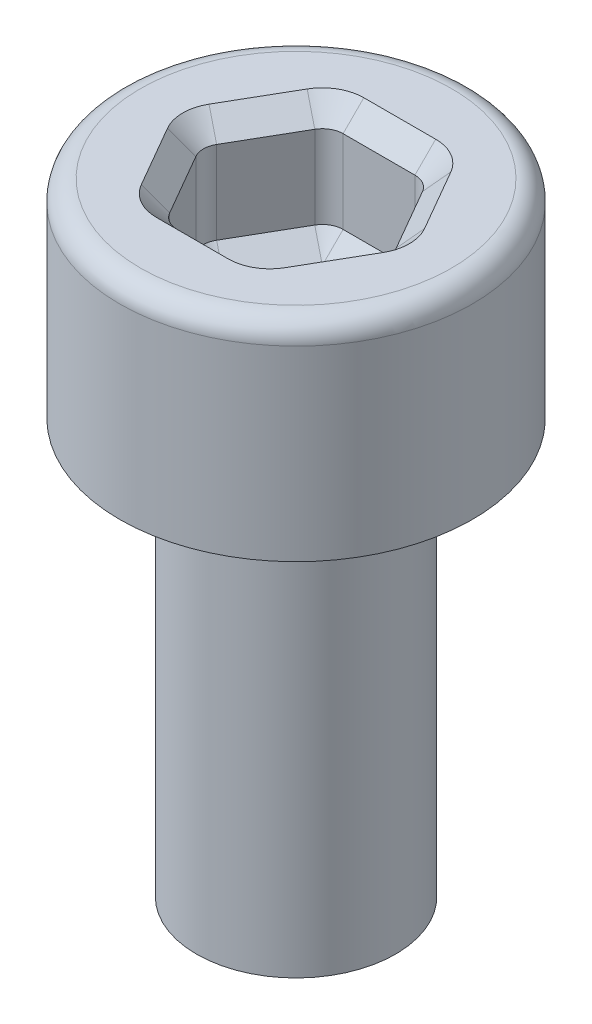
ISO-10303-21;
HEADER;
FILE_DESCRIPTION(('STEP AP214'),'2;1');
FILE_NAME('part.step','',(''),(''),'','','');
FILE_SCHEMA(('AUTOMOTIVE_DESIGN { 1 0 10303 214 1 1 1 1 }'));
ENDSEC;
DATA;
#1=APPLICATION_CONTEXT('core data for automotive mechanical design processes');
#2=APPLICATION_PROTOCOL_DEFINITION('international standard','automotive_design',2000,#1);
#3=PRODUCT_CONTEXT('',#1,'mechanical');
#4=PRODUCT('Part','Part','',(#3));
#5=PRODUCT_RELATED_PRODUCT_CATEGORY('part','',(#4));
#6=PRODUCT_DEFINITION_FORMATION('','',#4);
#7=PRODUCT_DEFINITION_CONTEXT('part definition',#1,'design');
#8=PRODUCT_DEFINITION('design','',#6,#7);
#9=PRODUCT_DEFINITION_SHAPE('','',#8);
#10=(LENGTH_UNIT() NAMED_UNIT(*) SI_UNIT(.MILLI.,.METRE.));
#11=(NAMED_UNIT(*) PLANE_ANGLE_UNIT() SI_UNIT($,.RADIAN.));
#12=(NAMED_UNIT(*) SI_UNIT($,.STERADIAN.) SOLID_ANGLE_UNIT());
#13=UNCERTAINTY_MEASURE_WITH_UNIT(LENGTH_MEASURE(1.E-05),#10,'distance_accuracy_value','');
#14=(GEOMETRIC_REPRESENTATION_CONTEXT(3) GLOBAL_UNCERTAINTY_ASSIGNED_CONTEXT((#13)) GLOBAL_UNIT_ASSIGNED_CONTEXT((#10,
#11,#12)) REPRESENTATION_CONTEXT('',''));
#15=CARTESIAN_POINT('',(0.,0.,0.));
#16=DIRECTION('',(0.,0.,1.));
#17=DIRECTION('',(1.,0.,0.));
#18=AXIS2_PLACEMENT_3D('',#15,#16,#17);
#19=CARTESIAN_POINT('',(0.,10.,0.));
#20=DIRECTION('',(0.,-1.,0.));
#21=DIRECTION('',(0.,0.,-1.));
#22=AXIS2_PLACEMENT_3D('',#19,#20,#21);
#23=CYLINDRICAL_SURFACE('',#22,2.4);
#24=CARTESIAN_POINT('',(0.,10.,0.));
#25=DIRECTION('',(0.,1.,0.));
#26=DIRECTION('',(0.,0.,1.));
#27=AXIS2_PLACEMENT_3D('',#24,#25,#26);
#28=CIRCLE('',#27,2.4);
#29=CARTESIAN_POINT('',(0.,10.,2.4));
#30=VERTEX_POINT('',#29);
#31=EDGE_CURVE('E210',#30,#30,#28,.T.);
#32=ORIENTED_EDGE('',*,*,#31,.F.);
#33=EDGE_LOOP('',(#32));
#34=FACE_BOUND('',#33,.T.);
#35=CARTESIAN_POINT('',(0.,0.,0.));
#36=DIRECTION('',(0.,1.,0.));
#37=DIRECTION('',(0.,0.,1.));
#38=AXIS2_PLACEMENT_3D('',#35,#36,#37);
#39=CIRCLE('',#38,2.4);
#40=CARTESIAN_POINT('',(0.,0.,2.4));
#41=VERTEX_POINT('',#40);
#42=EDGE_CURVE('E389',#41,#41,#39,.T.);
#43=ORIENTED_EDGE('',*,*,#42,.T.);
#44=EDGE_LOOP('',(#43));
#45=FACE_BOUND('',#44,.T.);
#46=ADVANCED_FACE('F41',(#34,#45),#23,.T.);
#47=CARTESIAN_POINT('',(0.,0.,0.));
#48=DIRECTION('',(0.,1.,0.));
#49=DIRECTION('',(0.,0.,1.));
#50=AXIS2_PLACEMENT_3D('',#47,#48,#49);
#51=PLANE('',#50);
#52=ORIENTED_EDGE('',*,*,#42,.F.);
#53=EDGE_LOOP('',(#52));
#54=FACE_BOUND('',#53,.T.);
#55=ADVANCED_FACE('F485',(#54),#51,.F.);
#56=CARTESIAN_POINT('',(0.,15.,0.));
#57=DIRECTION('',(0.,-1.,0.));
#58=DIRECTION('',(0.,0.,-1.));
#59=AXIS2_PLACEMENT_3D('',#56,#57,#58);
#60=CYLINDRICAL_SURFACE('',#59,4.25);
#61=CARTESIAN_POINT('',(0.,14.5,0.));
#62=DIRECTION('',(0.,1.,0.));
#63=DIRECTION('',(0.,0.,1.));
#64=AXIS2_PLACEMENT_3D('',#61,#62,#63);
#65=CIRCLE('',#64,4.25);
#66=CARTESIAN_POINT('',(0.,14.5,4.25));
#67=VERTEX_POINT('',#66);
#68=EDGE_CURVE('E11',#67,#67,#65,.F.);
#69=ORIENTED_EDGE('',*,*,#68,.T.);
#70=EDGE_LOOP('',(#69));
#71=FACE_BOUND('',#70,.T.);
#72=CARTESIAN_POINT('',(0.,10.,0.));
#73=DIRECTION('',(0.,1.,0.));
#74=DIRECTION('',(0.,0.,1.));
#75=AXIS2_PLACEMENT_3D('',#72,#73,#74);
#76=CIRCLE('',#75,4.25);
#77=CARTESIAN_POINT('',(0.,10.,4.25));
#78=VERTEX_POINT('',#77);
#79=EDGE_CURVE('E392',#78,#78,#76,.T.);
#80=ORIENTED_EDGE('',*,*,#79,.T.);
#81=EDGE_LOOP('',(#80));
#82=FACE_BOUND('',#81,.T.);
#83=ADVANCED_FACE('F491',(#71,#82),#60,.T.);
#84=CARTESIAN_POINT('',(0.,15.,0.));
#85=DIRECTION('',(0.,1.,0.));
#86=DIRECTION('',(0.,0.,1.));
#87=AXIS2_PLACEMENT_3D('',#84,#85,#86);
#88=PLANE('',#87);
#89=CARTESIAN_POINT('',(0.,15.,0.));
#90=DIRECTION('',(0.,1.,0.));
#91=DIRECTION('',(0.,0.,1.));
#92=AXIS2_PLACEMENT_3D('',#89,#90,#91);
#93=CIRCLE('',#92,3.75);
#94=CARTESIAN_POINT('',(0.,15.,3.75));
#95=VERTEX_POINT('',#94);
#96=EDGE_CURVE('E49',#95,#95,#93,.T.);
#97=ORIENTED_EDGE('',*,*,#96,.T.);
#98=EDGE_LOOP('',(#97));
#99=FACE_BOUND('',#98,.T.);
#100=CARTESIAN_POINT('',(1.73205080756888,15.,0.));
#101=DIRECTION('',(0.,1.,0.));
#102=DIRECTION('',(0.,0.,1.));
#103=AXIS2_PLACEMENT_3D('',#100,#101,#102);
#104=CIRCLE('',#103,1.00000000000001);
#105=CARTESIAN_POINT('',(2.59807621135332,15.,-0.500000000000008));
#106=VERTEX_POINT('',#105);
#107=CARTESIAN_POINT('',(2.59807621135332,15.,0.500000000000004));
#108=VERTEX_POINT('',#107);
#109=EDGE_CURVE('E56',#106,#108,#104,.F.);
#110=ORIENTED_EDGE('',*,*,#109,.T.);
#111=DIRECTION('',(-0.5,0.,0.866025403784439));
#112=VECTOR('',#111,1.);
#113=CARTESIAN_POINT('',(1.73205080756888,15.,2.));
#114=LINE('',#113,#112);
#115=CARTESIAN_POINT('',(1.73205080756888,15.,2.));
#116=VERTEX_POINT('',#115);
#117=EDGE_CURVE('E267',#108,#116,#114,.T.);
#118=ORIENTED_EDGE('',*,*,#117,.T.);
#119=CARTESIAN_POINT('',(0.866025403784438,15.,1.5));
#120=DIRECTION('',(0.,1.,0.));
#121=DIRECTION('',(0.,0.,1.));
#122=AXIS2_PLACEMENT_3D('',#119,#120,#121);
#123=CIRCLE('',#122,1.00000000000001);
#124=CARTESIAN_POINT('',(0.866025403784434,15.,2.50000000000001));
#125=VERTEX_POINT('',#124);
#126=EDGE_CURVE('E271',#116,#125,#123,.F.);
#127=ORIENTED_EDGE('',*,*,#126,.T.);
#128=DIRECTION('',(-1.,0.,0.));
#129=VECTOR('',#128,1.);
#130=CARTESIAN_POINT('',(-0.866025403784436,15.,2.50000000000001));
#131=LINE('',#130,#129);
#132=CARTESIAN_POINT('',(-0.866025403784436,15.,2.50000000000001));
#133=VERTEX_POINT('',#132);
#134=EDGE_CURVE('E353',#125,#133,#131,.T.);
#135=ORIENTED_EDGE('',*,*,#134,.T.);
#136=CARTESIAN_POINT('',(-0.866025403784439,15.,1.5));
#137=DIRECTION('',(0.,1.,0.));
#138=DIRECTION('',(0.,0.,1.));
#139=AXIS2_PLACEMENT_3D('',#136,#137,#138);
#140=CIRCLE('',#139,1.00000000000001);
#141=CARTESIAN_POINT('',(-1.73205080756889,15.,2.));
#142=VERTEX_POINT('',#141);
#143=EDGE_CURVE('E349',#133,#142,#140,.F.);
#144=ORIENTED_EDGE('',*,*,#143,.T.);
#145=DIRECTION('',(-0.5,0.,-0.866025403784439));
#146=VECTOR('',#145,1.);
#147=CARTESIAN_POINT('',(-2.59807621135332,15.,0.500000000000005));
#148=LINE('',#147,#146);
#149=CARTESIAN_POINT('',(-2.59807621135332,15.,0.500000000000005));
#150=VERTEX_POINT('',#149);
#151=EDGE_CURVE('E345',#142,#150,#148,.T.);
#152=ORIENTED_EDGE('',*,*,#151,.T.);
#153=CARTESIAN_POINT('',(-1.73205080756888,15.,0.));
#154=DIRECTION('',(0.,1.,0.));
#155=DIRECTION('',(0.,0.,1.));
#156=AXIS2_PLACEMENT_3D('',#153,#154,#155);
#157=CIRCLE('',#156,1.00000000000001);
#158=CARTESIAN_POINT('',(-2.59807621135332,15.,-0.500000000000007));
#159=VERTEX_POINT('',#158);
#160=EDGE_CURVE('E341',#150,#159,#157,.F.);
#161=ORIENTED_EDGE('',*,*,#160,.T.);
#162=DIRECTION('',(0.5,0.,-0.866025403784439));
#163=VECTOR('',#162,1.);
#164=CARTESIAN_POINT('',(-1.73205080756888,15.,-2.));
#165=LINE('',#164,#163);
#166=CARTESIAN_POINT('',(-1.73205080756888,15.,-2.));
#167=VERTEX_POINT('',#166);
#168=EDGE_CURVE('E339',#159,#167,#165,.T.);
#169=ORIENTED_EDGE('',*,*,#168,.T.);
#170=CARTESIAN_POINT('',(-0.866025403784438,15.,-1.5));
#171=DIRECTION('',(0.,1.,0.));
#172=DIRECTION('',(0.,0.,1.));
#173=AXIS2_PLACEMENT_3D('',#170,#171,#172);
#174=CIRCLE('',#173,1.00000000000001);
#175=CARTESIAN_POINT('',(-0.866025403784438,15.,-2.50000000000001));
#176=VERTEX_POINT('',#175);
#177=EDGE_CURVE('E343',#167,#176,#174,.F.);
#178=ORIENTED_EDGE('',*,*,#177,.T.);
#179=DIRECTION('',(1.,0.,0.));
#180=VECTOR('',#179,1.);
#181=CARTESIAN_POINT('',(0.866025403784436,15.,-2.50000000000001));
#182=LINE('',#181,#180);
#183=CARTESIAN_POINT('',(0.866025403784433,15.,-2.50000000000001));
#184=VERTEX_POINT('',#183);
#185=EDGE_CURVE('E347',#176,#184,#182,.T.);
#186=ORIENTED_EDGE('',*,*,#185,.T.);
#187=CARTESIAN_POINT('',(0.866025403784438,15.,-1.5));
#188=DIRECTION('',(0.,1.,0.));
#189=DIRECTION('',(0.,0.,1.));
#190=AXIS2_PLACEMENT_3D('',#187,#188,#189);
#191=CIRCLE('',#190,1.00000000000001);
#192=CARTESIAN_POINT('',(1.73205080756888,15.,-2.));
#193=VERTEX_POINT('',#192);
#194=EDGE_CURVE('E351',#184,#193,#191,.F.);
#195=ORIENTED_EDGE('',*,*,#194,.T.);
#196=DIRECTION('',(0.5,0.,0.866025403784439));
#197=VECTOR('',#196,1.);
#198=CARTESIAN_POINT('',(2.59807621135332,15.,-0.500000000000006));
#199=LINE('',#198,#197);
#200=EDGE_CURVE('E355',#193,#106,#199,.T.);
#201=ORIENTED_EDGE('',*,*,#200,.T.);
#202=EDGE_LOOP('',(#110,#118,#127,#135,#144,#152,#161,#169,#178,#186,#195,#201));
#203=FACE_BOUND('',#202,.T.);
#204=ADVANCED_FACE('F357',(#99,#203),#88,.T.);
#205=CARTESIAN_POINT('',(0.,10.,0.));
#206=DIRECTION('',(0.,1.,0.));
#207=DIRECTION('',(0.,0.,1.));
#208=AXIS2_PLACEMENT_3D('',#205,#206,#207);
#209=PLANE('',#208);
#210=ORIENTED_EDGE('',*,*,#31,.T.);
#211=EDGE_LOOP('',(#210));
#212=FACE_BOUND('',#211,.T.);
#213=ORIENTED_EDGE('',*,*,#79,.F.);
#214=EDGE_LOOP('',(#213));
#215=FACE_BOUND('',#214,.T.);
#216=ADVANCED_FACE('F703',(#212,#215),#209,.F.);
#217=CARTESIAN_POINT('',(-1.73205080756888,12.,0.));
#218=DIRECTION('',(0.,1.,0.));
#219=DIRECTION('',(0.,0.,1.));
#220=AXIS2_PLACEMENT_3D('',#217,#218,#219);
#221=CYLINDRICAL_SURFACE('',#220,0.5);
#222=DIRECTION('',(0.,1.,0.));
#223=VECTOR('',#222,1.);
#224=CARTESIAN_POINT('',(-2.1650635094611,12.,0.250000000000002));
#225=LINE('',#224,#223);
#226=CARTESIAN_POINT('',(-2.1650635094611,12.5,0.250000000000002));
#227=VERTEX_POINT('',#226);
#228=CARTESIAN_POINT('',(-2.1650635094611,14.5,0.250000000000002));
#229=VERTEX_POINT('',#228);
#230=EDGE_CURVE('E232',#227,#229,#225,.T.);
#231=ORIENTED_EDGE('',*,*,#230,.F.);
#232=CARTESIAN_POINT('',(-1.73205080756888,12.5,0.));
#233=DIRECTION('',(0.,1.,0.));
#234=DIRECTION('',(0.,0.,1.));
#235=AXIS2_PLACEMENT_3D('',#232,#233,#234);
#236=CIRCLE('',#235,0.5);
#237=CARTESIAN_POINT('',(-2.1650635094611,12.5,-0.250000000000002));
#238=VERTEX_POINT('',#237);
#239=EDGE_CURVE('E333',#227,#238,#236,.F.);
#240=ORIENTED_EDGE('',*,*,#239,.T.);
#241=DIRECTION('',(0.,1.,0.));
#242=VECTOR('',#241,1.);
#243=CARTESIAN_POINT('',(-2.1650635094611,12.,-0.250000000000002));
#244=LINE('',#243,#242);
#245=CARTESIAN_POINT('',(-2.1650635094611,14.5,-0.250000000000002));
#246=VERTEX_POINT('',#245);
#247=EDGE_CURVE('E397',#238,#246,#244,.T.);
#248=ORIENTED_EDGE('',*,*,#247,.T.);
#249=CARTESIAN_POINT('',(-1.73205080756888,14.5,0.));
#250=DIRECTION('',(0.,1.,0.));
#251=DIRECTION('',(0.,0.,1.));
#252=AXIS2_PLACEMENT_3D('',#249,#250,#251);
#253=CIRCLE('',#252,0.5);
#254=EDGE_CURVE('E331',#246,#229,#253,.T.);
#255=ORIENTED_EDGE('',*,*,#254,.T.);
#256=EDGE_LOOP('',(#231,#240,#248,#255));
#257=FACE_BOUND('',#256,.T.);
#258=ADVANCED_FACE('F432',(#257),#221,.F.);
#259=CARTESIAN_POINT('',(-1.29903810567666,12.,-1.75));
#260=DIRECTION('',(-0.866025403784438,0.,-0.5));
#261=DIRECTION('',(-0.5,0.,0.866025403784439));
#262=AXIS2_PLACEMENT_3D('',#259,#260,#261);
#263=PLANE('',#262);
#264=ORIENTED_EDGE('',*,*,#247,.F.);
#265=DIRECTION('',(0.5,0.,-0.866025403784439));
#266=VECTOR('',#265,1.);
#267=CARTESIAN_POINT('',(-1.29903810567666,12.5,-1.75));
#268=LINE('',#267,#266);
#269=CARTESIAN_POINT('',(-1.29903810567666,12.5,-1.75));
#270=VERTEX_POINT('',#269);
#271=EDGE_CURVE('E337',#238,#270,#268,.T.);
#272=ORIENTED_EDGE('',*,*,#271,.T.);
#273=DIRECTION('',(0.,1.,0.));
#274=VECTOR('',#273,1.);
#275=CARTESIAN_POINT('',(-1.29903810567666,12.,-1.75));
#276=LINE('',#275,#274);
#277=CARTESIAN_POINT('',(-1.29903810567666,14.5,-1.75));
#278=VERTEX_POINT('',#277);
#279=EDGE_CURVE('E424',#270,#278,#276,.T.);
#280=ORIENTED_EDGE('',*,*,#279,.T.);
#281=DIRECTION('',(-0.5,0.,0.866025403784439));
#282=VECTOR('',#281,1.);
#283=CARTESIAN_POINT('',(-2.1650635094611,14.5,-0.250000000000002));
#284=LINE('',#283,#282);
#285=EDGE_CURVE('E335',#278,#246,#284,.T.);
#286=ORIENTED_EDGE('',*,*,#285,.T.);
#287=EDGE_LOOP('',(#264,#272,#280,#286));
#288=FACE_BOUND('',#287,.T.);
#289=ADVANCED_FACE('F873',(#288),#263,.F.);
#290=CARTESIAN_POINT('',(-0.866025403784438,12.,-1.5));
#291=DIRECTION('',(0.,1.,0.));
#292=DIRECTION('',(0.,0.,1.));
#293=AXIS2_PLACEMENT_3D('',#290,#291,#292);
#294=CYLINDRICAL_SURFACE('',#293,0.5);
#295=ORIENTED_EDGE('',*,*,#279,.F.);
#296=CARTESIAN_POINT('',(-0.866025403784438,12.5,-1.5));
#297=DIRECTION('',(0.,1.,0.));
#298=DIRECTION('',(0.,0.,1.));
#299=AXIS2_PLACEMENT_3D('',#296,#297,#298);
#300=CIRCLE('',#299,0.5);
#301=CARTESIAN_POINT('',(-0.866025403784438,12.5,-2.));
#302=VERTEX_POINT('',#301);
#303=EDGE_CURVE('E217',#270,#302,#300,.F.);
#304=ORIENTED_EDGE('',*,*,#303,.T.);
#305=DIRECTION('',(0.,1.,0.));
#306=VECTOR('',#305,1.);
#307=CARTESIAN_POINT('',(-0.866025403784438,12.,-2.));
#308=LINE('',#307,#306);
#309=CARTESIAN_POINT('',(-0.866025403784438,14.5,-2.));
#310=VERTEX_POINT('',#309);
#311=EDGE_CURVE('E421',#302,#310,#308,.T.);
#312=ORIENTED_EDGE('',*,*,#311,.T.);
#313=CARTESIAN_POINT('',(-0.866025403784438,14.5,-1.5));
#314=DIRECTION('',(0.,1.,0.));
#315=DIRECTION('',(0.,0.,1.));
#316=AXIS2_PLACEMENT_3D('',#313,#314,#315);
#317=CIRCLE('',#316,0.5);
#318=EDGE_CURVE('E328',#310,#278,#317,.T.);
#319=ORIENTED_EDGE('',*,*,#318,.T.);
#320=EDGE_LOOP('',(#295,#304,#312,#319));
#321=FACE_BOUND('',#320,.T.);
#322=ADVANCED_FACE('F864',(#321),#294,.F.);
#323=CARTESIAN_POINT('',(0.866025403784436,12.,-2.));
#324=DIRECTION('',(0.,0.,-1.));
#325=DIRECTION('',(-1.,0.,0.));
#326=AXIS2_PLACEMENT_3D('',#323,#324,#325);
#327=PLANE('',#326);
#328=ORIENTED_EDGE('',*,*,#311,.F.);
#329=DIRECTION('',(1.,0.,0.));
#330=VECTOR('',#329,1.);
#331=CARTESIAN_POINT('',(0.866025403784436,12.5,-2.));
#332=LINE('',#331,#330);
#333=CARTESIAN_POINT('',(0.866025403784436,12.5,-2.));
#334=VERTEX_POINT('',#333);
#335=EDGE_CURVE('E221',#302,#334,#332,.T.);
#336=ORIENTED_EDGE('',*,*,#335,.T.);
#337=DIRECTION('',(0.,1.,0.));
#338=VECTOR('',#337,1.);
#339=CARTESIAN_POINT('',(0.866025403784436,12.,-2.));
#340=LINE('',#339,#338);
#341=CARTESIAN_POINT('',(0.866025403784436,14.5,-2.));
#342=VERTEX_POINT('',#341);
#343=EDGE_CURVE('E418',#334,#342,#340,.T.);
#344=ORIENTED_EDGE('',*,*,#343,.T.);
#345=DIRECTION('',(-1.,0.,0.));
#346=VECTOR('',#345,1.);
#347=CARTESIAN_POINT('',(-0.866025403784438,14.5,-2.));
#348=LINE('',#347,#346);
#349=EDGE_CURVE('E321',#342,#310,#348,.T.);
#350=ORIENTED_EDGE('',*,*,#349,.T.);
#351=EDGE_LOOP('',(#328,#336,#344,#350));
#352=FACE_BOUND('',#351,.T.);
#353=ADVANCED_FACE('F855',(#352),#327,.F.);
#354=CARTESIAN_POINT('',(0.866025403784438,12.,-1.5));
#355=DIRECTION('',(0.,1.,0.));
#356=DIRECTION('',(0.,0.,1.));
#357=AXIS2_PLACEMENT_3D('',#354,#355,#356);
#358=CYLINDRICAL_SURFACE('',#357,0.5);
#359=ORIENTED_EDGE('',*,*,#343,.F.);
#360=CARTESIAN_POINT('',(0.866025403784438,12.5,-1.5));
#361=DIRECTION('',(0.,1.,0.));
#362=DIRECTION('',(0.,0.,1.));
#363=AXIS2_PLACEMENT_3D('',#360,#361,#362);
#364=CIRCLE('',#363,0.5);
#365=CARTESIAN_POINT('',(1.29903810567666,12.5,-1.75));
#366=VERTEX_POINT('',#365);
#367=EDGE_CURVE('E294',#334,#366,#364,.F.);
#368=ORIENTED_EDGE('',*,*,#367,.T.);
#369=DIRECTION('',(0.,1.,0.));
#370=VECTOR('',#369,1.);
#371=CARTESIAN_POINT('',(1.29903810567666,12.,-1.75));
#372=LINE('',#371,#370);
#373=CARTESIAN_POINT('',(1.29903810567666,14.5,-1.75));
#374=VERTEX_POINT('',#373);
#375=EDGE_CURVE('E415',#366,#374,#372,.T.);
#376=ORIENTED_EDGE('',*,*,#375,.T.);
#377=CARTESIAN_POINT('',(0.866025403784438,14.5,-1.5));
#378=DIRECTION('',(0.,1.,0.));
#379=DIRECTION('',(0.,0.,1.));
#380=AXIS2_PLACEMENT_3D('',#377,#378,#379);
#381=CIRCLE('',#380,0.5);
#382=EDGE_CURVE('E314',#374,#342,#381,.T.);
#383=ORIENTED_EDGE('',*,*,#382,.T.);
#384=EDGE_LOOP('',(#359,#368,#376,#383));
#385=FACE_BOUND('',#384,.T.);
#386=ADVANCED_FACE('F847',(#385),#358,.F.);
#387=CARTESIAN_POINT('',(2.1650635094611,12.,-0.250000000000003));
#388=DIRECTION('',(0.866025403784439,0.,-0.5));
#389=DIRECTION('',(-0.5,0.,-0.866025403784439));
#390=AXIS2_PLACEMENT_3D('',#387,#388,#389);
#391=PLANE('',#390);
#392=ORIENTED_EDGE('',*,*,#375,.F.);
#393=DIRECTION('',(0.5,0.,0.866025403784439));
#394=VECTOR('',#393,1.);
#395=CARTESIAN_POINT('',(2.1650635094611,12.5,-0.250000000000003));
#396=LINE('',#395,#394);
#397=CARTESIAN_POINT('',(2.1650635094611,12.5,-0.250000000000003));
#398=VERTEX_POINT('',#397);
#399=EDGE_CURVE('E298',#366,#398,#396,.T.);
#400=ORIENTED_EDGE('',*,*,#399,.T.);
#401=DIRECTION('',(0.,1.,0.));
#402=VECTOR('',#401,1.);
#403=CARTESIAN_POINT('',(2.1650635094611,12.,-0.250000000000003));
#404=LINE('',#403,#402);
#405=CARTESIAN_POINT('',(2.1650635094611,14.5,-0.250000000000003));
#406=VERTEX_POINT('',#405);
#407=EDGE_CURVE('E413',#398,#406,#404,.T.);
#408=ORIENTED_EDGE('',*,*,#407,.T.);
#409=DIRECTION('',(-0.5,0.,-0.866025403784439));
#410=VECTOR('',#409,1.);
#411=CARTESIAN_POINT('',(1.29903810567666,14.5,-1.75));
#412=LINE('',#411,#410);
#413=EDGE_CURVE('E305',#406,#374,#412,.T.);
#414=ORIENTED_EDGE('',*,*,#413,.T.);
#415=EDGE_LOOP('',(#392,#400,#408,#414));
#416=FACE_BOUND('',#415,.T.);
#417=ADVANCED_FACE('F838',(#416),#391,.F.);
#418=CARTESIAN_POINT('',(1.73205080756888,12.,0.));
#419=DIRECTION('',(0.,1.,0.));
#420=DIRECTION('',(0.,0.,1.));
#421=AXIS2_PLACEMENT_3D('',#418,#419,#420);
#422=CYLINDRICAL_SURFACE('',#421,0.5);
#423=ORIENTED_EDGE('',*,*,#407,.F.);
#424=CARTESIAN_POINT('',(1.73205080756888,12.5,0.));
#425=DIRECTION('',(0.,1.,0.));
#426=DIRECTION('',(0.,0.,1.));
#427=AXIS2_PLACEMENT_3D('',#424,#425,#426);
#428=CIRCLE('',#427,0.5);
#429=CARTESIAN_POINT('',(2.1650635094611,12.5,0.250000000000001));
#430=VERTEX_POINT('',#429);
#431=EDGE_CURVE('E372',#398,#430,#428,.F.);
#432=ORIENTED_EDGE('',*,*,#431,.T.);
#433=DIRECTION('',(0.,1.,0.));
#434=VECTOR('',#433,1.);
#435=CARTESIAN_POINT('',(2.1650635094611,12.,0.250000000000001));
#436=LINE('',#435,#434);
#437=CARTESIAN_POINT('',(2.1650635094611,14.5,0.250000000000001));
#438=VERTEX_POINT('',#437);
#439=EDGE_CURVE('E410',#430,#438,#436,.T.);
#440=ORIENTED_EDGE('',*,*,#439,.T.);
#441=CARTESIAN_POINT('',(1.73205080756888,14.5,0.));
#442=DIRECTION('',(0.,1.,0.));
#443=DIRECTION('',(0.,0.,1.));
#444=AXIS2_PLACEMENT_3D('',#441,#442,#443);
#445=CIRCLE('',#444,0.5);
#446=EDGE_CURVE('E374',#438,#406,#445,.T.);
#447=ORIENTED_EDGE('',*,*,#446,.T.);
#448=EDGE_LOOP('',(#423,#432,#440,#447));
#449=FACE_BOUND('',#448,.T.);
#450=ADVANCED_FACE('F829',(#449),#422,.F.);
#451=CARTESIAN_POINT('',(1.29903810567666,12.,1.75));
#452=DIRECTION('',(0.866025403784439,0.,0.5));
#453=DIRECTION('',(0.5,0.,-0.866025403784439));
#454=AXIS2_PLACEMENT_3D('',#451,#452,#453);
#455=PLANE('',#454);
#456=ORIENTED_EDGE('',*,*,#439,.F.);
#457=DIRECTION('',(-0.5,0.,0.866025403784439));
#458=VECTOR('',#457,1.);
#459=CARTESIAN_POINT('',(1.29903810567666,12.5,1.75));
#460=LINE('',#459,#458);
#461=CARTESIAN_POINT('',(1.29903810567666,12.5,1.75));
#462=VERTEX_POINT('',#461);
#463=EDGE_CURVE('E378',#430,#462,#460,.T.);
#464=ORIENTED_EDGE('',*,*,#463,.T.);
#465=DIRECTION('',(0.,1.,0.));
#466=VECTOR('',#465,1.);
#467=CARTESIAN_POINT('',(1.29903810567666,12.,1.75));
#468=LINE('',#467,#466);
#469=CARTESIAN_POINT('',(1.29903810567666,14.5,1.75));
#470=VERTEX_POINT('',#469);
#471=EDGE_CURVE('E408',#462,#470,#468,.T.);
#472=ORIENTED_EDGE('',*,*,#471,.T.);
#473=DIRECTION('',(0.5,0.,-0.866025403784439));
#474=VECTOR('',#473,1.);
#475=CARTESIAN_POINT('',(2.1650635094611,14.5,0.250000000000001));
#476=LINE('',#475,#474);
#477=EDGE_CURVE('E381',#470,#438,#476,.T.);
#478=ORIENTED_EDGE('',*,*,#477,.T.);
#479=EDGE_LOOP('',(#456,#464,#472,#478));
#480=FACE_BOUND('',#479,.T.);
#481=ADVANCED_FACE('F821',(#480),#455,.F.);
#482=CARTESIAN_POINT('',(0.866025403784438,12.,1.5));
#483=DIRECTION('',(0.,1.,0.));
#484=DIRECTION('',(0.,0.,1.));
#485=AXIS2_PLACEMENT_3D('',#482,#483,#484);
#486=CYLINDRICAL_SURFACE('',#485,0.5);
#487=ORIENTED_EDGE('',*,*,#471,.F.);
#488=CARTESIAN_POINT('',(0.866025403784438,12.5,1.5));
#489=DIRECTION('',(0.,1.,0.));
#490=DIRECTION('',(0.,0.,1.));
#491=AXIS2_PLACEMENT_3D('',#488,#489,#490);
#492=CIRCLE('',#491,0.5);
#493=CARTESIAN_POINT('',(0.866025403784436,12.5,2.));
#494=VERTEX_POINT('',#493);
#495=EDGE_CURVE('E309',#462,#494,#492,.F.);
#496=ORIENTED_EDGE('',*,*,#495,.T.);
#497=DIRECTION('',(0.,1.,0.));
#498=VECTOR('',#497,1.);
#499=CARTESIAN_POINT('',(0.866025403784436,12.,2.));
#500=LINE('',#499,#498);
#501=CARTESIAN_POINT('',(0.866025403784436,14.5,2.));
#502=VERTEX_POINT('',#501);
#503=EDGE_CURVE('E406',#494,#502,#500,.T.);
#504=ORIENTED_EDGE('',*,*,#503,.T.);
#505=CARTESIAN_POINT('',(0.866025403784438,14.5,1.5));
#506=DIRECTION('',(0.,1.,0.));
#507=DIRECTION('',(0.,0.,1.));
#508=AXIS2_PLACEMENT_3D('',#505,#506,#507);
#509=CIRCLE('',#508,0.5);
#510=EDGE_CURVE('E367',#502,#470,#509,.T.);
#511=ORIENTED_EDGE('',*,*,#510,.T.);
#512=EDGE_LOOP('',(#487,#496,#504,#511));
#513=FACE_BOUND('',#512,.T.);
#514=ADVANCED_FACE('F812',(#513),#486,.F.);
#515=CARTESIAN_POINT('',(-0.866025403784436,12.,2.));
#516=DIRECTION('',(0.,0.,1.));
#517=DIRECTION('',(1.,0.,0.));
#518=AXIS2_PLACEMENT_3D('',#515,#516,#517);
#519=PLANE('',#518);
#520=ORIENTED_EDGE('',*,*,#503,.F.);
#521=DIRECTION('',(-1.,0.,0.));
#522=VECTOR('',#521,1.);
#523=CARTESIAN_POINT('',(-0.866025403784436,12.5,2.));
#524=LINE('',#523,#522);
#525=CARTESIAN_POINT('',(-0.866025403784436,12.5,2.));
#526=VERTEX_POINT('',#525);
#527=EDGE_CURVE('E307',#494,#526,#524,.T.);
#528=ORIENTED_EDGE('',*,*,#527,.T.);
#529=DIRECTION('',(0.,1.,0.));
#530=VECTOR('',#529,1.);
#531=CARTESIAN_POINT('',(-0.866025403784436,12.,2.));
#532=LINE('',#531,#530);
#533=CARTESIAN_POINT('',(-0.866025403784436,14.5,2.));
#534=VERTEX_POINT('',#533);
#535=EDGE_CURVE('E403',#526,#534,#532,.T.);
#536=ORIENTED_EDGE('',*,*,#535,.T.);
#537=DIRECTION('',(1.,0.,0.));
#538=VECTOR('',#537,1.);
#539=CARTESIAN_POINT('',(0.866025403784436,14.5,2.));
#540=LINE('',#539,#538);
#541=EDGE_CURVE('E304',#534,#502,#540,.T.);
#542=ORIENTED_EDGE('',*,*,#541,.T.);
#543=EDGE_LOOP('',(#520,#528,#536,#542));
#544=FACE_BOUND('',#543,.T.);
#545=ADVANCED_FACE('F804',(#544),#519,.F.);
#546=CARTESIAN_POINT('',(-0.866025403784439,12.,1.5));
#547=DIRECTION('',(0.,1.,0.));
#548=DIRECTION('',(0.,0.,1.));
#549=AXIS2_PLACEMENT_3D('',#546,#547,#548);
#550=CYLINDRICAL_SURFACE('',#549,0.5);
#551=ORIENTED_EDGE('',*,*,#535,.F.);
#552=CARTESIAN_POINT('',(-0.866025403784439,12.5,1.5));
#553=DIRECTION('',(0.,1.,0.));
#554=DIRECTION('',(0.,0.,1.));
#555=AXIS2_PLACEMENT_3D('',#552,#553,#554);
#556=CIRCLE('',#555,0.5);
#557=CARTESIAN_POINT('',(-1.29903810567666,12.5,1.75));
#558=VERTEX_POINT('',#557);
#559=EDGE_CURVE('E319',#526,#558,#556,.F.);
#560=ORIENTED_EDGE('',*,*,#559,.T.);
#561=DIRECTION('',(0.,1.,0.));
#562=VECTOR('',#561,1.);
#563=CARTESIAN_POINT('',(-1.29903810567666,12.,1.75));
#564=LINE('',#563,#562);
#565=CARTESIAN_POINT('',(-1.29903810567666,14.5,1.75));
#566=VERTEX_POINT('',#565);
#567=EDGE_CURVE('E400',#558,#566,#564,.T.);
#568=ORIENTED_EDGE('',*,*,#567,.T.);
#569=CARTESIAN_POINT('',(-0.866025403784439,14.5,1.5));
#570=DIRECTION('',(0.,1.,0.));
#571=DIRECTION('',(0.,0.,1.));
#572=AXIS2_PLACEMENT_3D('',#569,#570,#571);
#573=CIRCLE('',#572,0.5);
#574=EDGE_CURVE('E317',#566,#534,#573,.T.);
#575=ORIENTED_EDGE('',*,*,#574,.T.);
#576=EDGE_LOOP('',(#551,#560,#568,#575));
#577=FACE_BOUND('',#576,.T.);
#578=ADVANCED_FACE('F457',(#577),#550,.F.);
#579=CARTESIAN_POINT('',(-2.1650635094611,12.,0.250000000000002));
#580=DIRECTION('',(-0.866025403784439,0.,0.5));
#581=DIRECTION('',(0.5,0.,0.866025403784439));
#582=AXIS2_PLACEMENT_3D('',#579,#580,#581);
#583=PLANE('',#582);
#584=ORIENTED_EDGE('',*,*,#567,.F.);
#585=DIRECTION('',(-0.5,0.,-0.866025403784439));
#586=VECTOR('',#585,1.);
#587=CARTESIAN_POINT('',(-2.1650635094611,12.5,0.250000000000002));
#588=LINE('',#587,#586);
#589=EDGE_CURVE('E326',#558,#227,#588,.T.);
#590=ORIENTED_EDGE('',*,*,#589,.T.);
#591=ORIENTED_EDGE('',*,*,#230,.T.);
#592=DIRECTION('',(0.5,0.,0.866025403784439));
#593=VECTOR('',#592,1.);
#594=CARTESIAN_POINT('',(-1.29903810567666,14.5,1.75));
#595=LINE('',#594,#593);
#596=EDGE_CURVE('E324',#229,#566,#595,.T.);
#597=ORIENTED_EDGE('',*,*,#596,.T.);
#598=EDGE_LOOP('',(#584,#590,#591,#597));
#599=FACE_BOUND('',#598,.T.);
#600=ADVANCED_FACE('F453',(#599),#583,.F.);
#601=CARTESIAN_POINT('',(-1.73205080756888,12.,0.));
#602=DIRECTION('',(0.,1.,0.));
#603=DIRECTION('',(0.,0.,1.));
#604=AXIS2_PLACEMENT_3D('',#601,#602,#603);
#605=PLANE('',#604);
#606=DIRECTION('',(1.,0.,0.));
#607=VECTOR('',#606,1.);
#608=CARTESIAN_POINT('',(-1.73205080756888,12.,1.49999999999999));
#609=LINE('',#608,#607);
#610=CARTESIAN_POINT('',(-0.866025403784433,12.,1.5));
#611=VERTEX_POINT('',#610);
#612=CARTESIAN_POINT('',(0.866025403784438,12.,1.49999999999999));
#613=VERTEX_POINT('',#612);
#614=EDGE_CURVE('E197',#611,#613,#609,.T.);
#615=ORIENTED_EDGE('',*,*,#614,.T.);
#616=DIRECTION('',(0.5,0.,-0.866025403784439));
#617=VECTOR('',#616,1.);
#618=CARTESIAN_POINT('',(0.866025403784434,12.,1.5));
#619=LINE('',#618,#617);
#620=CARTESIAN_POINT('',(1.73205080756887,12.,0.));
#621=VERTEX_POINT('',#620);
#622=EDGE_CURVE('E384',#613,#621,#619,.T.);
#623=ORIENTED_EDGE('',*,*,#622,.T.);
#624=DIRECTION('',(-0.5,0.,-0.866025403784439));
#625=VECTOR('',#624,1.);
#626=CARTESIAN_POINT('',(0.866025403784434,12.,-1.5));
#627=LINE('',#626,#625);
#628=CARTESIAN_POINT('',(0.866025403784438,12.,-1.49999999999999));
#629=VERTEX_POINT('',#628);
#630=EDGE_CURVE('E192',#621,#629,#627,.T.);
#631=ORIENTED_EDGE('',*,*,#630,.T.);
#632=DIRECTION('',(-1.,0.,0.));
#633=VECTOR('',#632,1.);
#634=CARTESIAN_POINT('',(-1.73205080756888,12.,-1.49999999999999));
#635=LINE('',#634,#633);
#636=CARTESIAN_POINT('',(-0.866025403784433,12.,-1.5));
#637=VERTEX_POINT('',#636);
#638=EDGE_CURVE('E185',#629,#637,#635,.T.);
#639=ORIENTED_EDGE('',*,*,#638,.T.);
#640=DIRECTION('',(-0.5,0.,0.866025403784439));
#641=VECTOR('',#640,1.);
#642=CARTESIAN_POINT('',(-1.73205080756887,12.,0.));
#643=LINE('',#642,#641);
#644=CARTESIAN_POINT('',(-1.73205080756887,12.,0.));
#645=VERTEX_POINT('',#644);
#646=EDGE_CURVE('E188',#637,#645,#643,.T.);
#647=ORIENTED_EDGE('',*,*,#646,.T.);
#648=DIRECTION('',(0.5,0.,0.866025403784439));
#649=VECTOR('',#648,1.);
#650=CARTESIAN_POINT('',(-1.73205080756887,12.,0.));
#651=LINE('',#650,#649);
#652=EDGE_CURVE('E198',#645,#611,#651,.T.);
#653=ORIENTED_EDGE('',*,*,#652,.T.);
#654=EDGE_LOOP('',(#615,#623,#631,#639,#647,#653));
#655=FACE_BOUND('',#654,.T.);
#656=ADVANCED_FACE('F187',(#655),#605,.T.);
#657=CARTESIAN_POINT('',(-1.73205080756887,12.,0.));
#658=DIRECTION('',(-0.612372435695791,-0.707106781186551,-0.353553390593272));
#659=DIRECTION('',(-0.5,0.,0.866025403784439));
#660=AXIS2_PLACEMENT_3D('',#657,#658,#659);
#661=PLANE('',#660);
#662=DIRECTION('',(0.612372435695799,-0.707106781186543,0.353553390593273));
#663=VECTOR('',#662,1.);
#664=CARTESIAN_POINT('',(-1.29903810567666,12.5,-1.75));
#665=LINE('',#664,#663);
#666=EDGE_CURVE('E205',#270,#637,#665,.T.);
#667=ORIENTED_EDGE('',*,*,#666,.F.);
#668=ORIENTED_EDGE('',*,*,#271,.F.);
#669=DIRECTION('',(-0.612372435695796,0.707106781186544,-0.353553390593278));
#670=VECTOR('',#669,1.);
#671=CARTESIAN_POINT('',(-1.73205080756887,12.,0.));
#672=LINE('',#671,#670);
#673=EDGE_CURVE('E208',#645,#238,#672,.T.);
#674=ORIENTED_EDGE('',*,*,#673,.F.);
#675=ORIENTED_EDGE('',*,*,#646,.F.);
#676=EDGE_LOOP('',(#667,#668,#674,#675));
#677=FACE_BOUND('',#676,.T.);
#678=ADVANCED_FACE('F203',(#677),#661,.F.);
#679=CARTESIAN_POINT('',(-1.73205080756888,12.5,0.));
#680=DIRECTION('',(0.,1.,0.));
#681=DIRECTION('',(0.,0.,1.));
#682=AXIS2_PLACEMENT_3D('',#679,#680,#681);
#683=CONICAL_SURFACE('',#682,0.500000000000006,0.785398163397454);
#684=ORIENTED_EDGE('',*,*,#673,.T.);
#685=ORIENTED_EDGE('',*,*,#239,.F.);
#686=DIRECTION('',(-0.612372435695798,0.707106781186543,0.353553390593276));
#687=VECTOR('',#686,1.);
#688=CARTESIAN_POINT('',(-1.73205080756887,12.,0.));
#689=LINE('',#688,#687);
#690=EDGE_CURVE('E218',#645,#227,#689,.T.);
#691=ORIENTED_EDGE('',*,*,#690,.F.);
#692=EDGE_LOOP('',(#684,#685,#691));
#693=FACE_BOUND('',#692,.T.);
#694=ADVANCED_FACE('F474',(#693),#683,.F.);
#695=CARTESIAN_POINT('',(-0.866025403784438,12.5,-1.5));
#696=DIRECTION('',(0.,1.,0.));
#697=DIRECTION('',(0.,0.,1.));
#698=AXIS2_PLACEMENT_3D('',#695,#696,#697);
#699=CONICAL_SURFACE('',#698,0.500000000000006,0.785398163397454);
#700=ORIENTED_EDGE('',*,*,#303,.F.);
#701=ORIENTED_EDGE('',*,*,#666,.T.);
#702=DIRECTION('',(0.,-0.707106781186543,0.707106781186552));
#703=VECTOR('',#702,1.);
#704=CARTESIAN_POINT('',(-0.866025403784438,12.5,-2.));
#705=LINE('',#704,#703);
#706=EDGE_CURVE('E215',#302,#637,#705,.T.);
#707=ORIENTED_EDGE('',*,*,#706,.F.);
#708=EDGE_LOOP('',(#700,#701,#707));
#709=FACE_BOUND('',#708,.T.);
#710=ADVANCED_FACE('F214',(#709),#699,.F.);
#711=CARTESIAN_POINT('',(-1.73205080756887,12.,0.));
#712=DIRECTION('',(-0.612372435695791,-0.707106781186552,0.353553390593272));
#713=DIRECTION('',(0.5,0.,0.866025403784439));
#714=AXIS2_PLACEMENT_3D('',#711,#712,#713);
#715=PLANE('',#714);
#716=ORIENTED_EDGE('',*,*,#690,.T.);
#717=ORIENTED_EDGE('',*,*,#589,.F.);
#718=DIRECTION('',(-0.6123724356958,0.707106781186543,0.353553390593273));
#719=VECTOR('',#718,1.);
#720=CARTESIAN_POINT('',(-0.866025403784433,12.,1.5));
#721=LINE('',#720,#719);
#722=EDGE_CURVE('E222',#611,#558,#721,.T.);
#723=ORIENTED_EDGE('',*,*,#722,.F.);
#724=ORIENTED_EDGE('',*,*,#652,.F.);
#725=EDGE_LOOP('',(#716,#717,#723,#724));
#726=FACE_BOUND('',#725,.T.);
#727=ADVANCED_FACE('F472',(#726),#715,.F.);
#728=CARTESIAN_POINT('',(-1.73205080756888,12.,-1.49999999999999));
#729=DIRECTION('',(0.,-0.707106781186552,-0.707106781186543));
#730=DIRECTION('',(-1.,0.,0.));
#731=AXIS2_PLACEMENT_3D('',#728,#729,#730);
#732=PLANE('',#731);
#733=ORIENTED_EDGE('',*,*,#706,.T.);
#734=ORIENTED_EDGE('',*,*,#638,.F.);
#735=DIRECTION('',(0.,-0.707106781186543,0.707106781186552));
#736=VECTOR('',#735,1.);
#737=CARTESIAN_POINT('',(0.866025403784436,12.5,-2.));
#738=LINE('',#737,#736);
#739=EDGE_CURVE('E227',#334,#629,#738,.T.);
#740=ORIENTED_EDGE('',*,*,#739,.F.);
#741=ORIENTED_EDGE('',*,*,#335,.F.);
#742=EDGE_LOOP('',(#733,#734,#740,#741));
#743=FACE_BOUND('',#742,.T.);
#744=ADVANCED_FACE('F220',(#743),#732,.F.);
#745=CARTESIAN_POINT('',(-0.866025403784439,12.5,1.5));
#746=DIRECTION('',(0.,1.,0.));
#747=DIRECTION('',(0.,0.,1.));
#748=AXIS2_PLACEMENT_3D('',#745,#746,#747);
#749=CONICAL_SURFACE('',#748,0.500000000000006,0.785398163397454);
#750=ORIENTED_EDGE('',*,*,#722,.T.);
#751=ORIENTED_EDGE('',*,*,#559,.F.);
#752=DIRECTION('',(0.,0.707106781186543,0.707106781186552));
#753=VECTOR('',#752,1.);
#754=CARTESIAN_POINT('',(-0.866025403784436,12.,1.49999999999999));
#755=LINE('',#754,#753);
#756=EDGE_CURVE('E287',#611,#526,#755,.T.);
#757=ORIENTED_EDGE('',*,*,#756,.F.);
#758=EDGE_LOOP('',(#750,#751,#757));
#759=FACE_BOUND('',#758,.T.);
#760=ADVANCED_FACE('F461',(#759),#749,.F.);
#761=CARTESIAN_POINT('',(0.866025403784438,12.5,-1.5));
#762=DIRECTION('',(0.,1.,0.));
#763=DIRECTION('',(0.,0.,1.));
#764=AXIS2_PLACEMENT_3D('',#761,#762,#763);
#765=CONICAL_SURFACE('',#764,0.500000000000006,0.785398163397454);
#766=ORIENTED_EDGE('',*,*,#367,.F.);
#767=ORIENTED_EDGE('',*,*,#739,.T.);
#768=DIRECTION('',(-0.612372435695798,-0.707106781186544,0.353553390593276));
#769=VECTOR('',#768,1.);
#770=CARTESIAN_POINT('',(1.29903810567666,12.5,-1.75));
#771=LINE('',#770,#769);
#772=EDGE_CURVE('E284',#366,#629,#771,.T.);
#773=ORIENTED_EDGE('',*,*,#772,.F.);
#774=EDGE_LOOP('',(#766,#767,#773));
#775=FACE_BOUND('',#774,.T.);
#776=ADVANCED_FACE('F292',(#775),#765,.F.);
#777=CARTESIAN_POINT('',(-1.73205080756888,12.,1.49999999999999));
#778=DIRECTION('',(0.,-0.707106781186552,0.707106781186543));
#779=DIRECTION('',(1.,0.,0.));
#780=AXIS2_PLACEMENT_3D('',#777,#778,#779);
#781=PLANE('',#780);
#782=ORIENTED_EDGE('',*,*,#756,.T.);
#783=ORIENTED_EDGE('',*,*,#527,.F.);
#784=DIRECTION('',(0.,0.707106781186543,0.707106781186552));
#785=VECTOR('',#784,1.);
#786=CARTESIAN_POINT('',(0.866025403784438,12.,1.49999999999999));
#787=LINE('',#786,#785);
#788=EDGE_CURVE('E281',#613,#494,#787,.T.);
#789=ORIENTED_EDGE('',*,*,#788,.F.);
#790=ORIENTED_EDGE('',*,*,#614,.F.);
#791=EDGE_LOOP('',(#782,#783,#789,#790));
#792=FACE_BOUND('',#791,.T.);
#793=ADVANCED_FACE('F466',(#792),#781,.F.);
#794=CARTESIAN_POINT('',(0.866025403784434,12.,-1.5));
#795=DIRECTION('',(0.612372435695791,-0.707106781186551,-0.353553390593272));
#796=DIRECTION('',(-0.5,0.,-0.866025403784439));
#797=AXIS2_PLACEMENT_3D('',#794,#795,#796);
#798=PLANE('',#797);
#799=ORIENTED_EDGE('',*,*,#772,.T.);
#800=ORIENTED_EDGE('',*,*,#630,.F.);
#801=DIRECTION('',(-0.612372435695796,-0.707106781186544,0.353553390593278));
#802=VECTOR('',#801,1.);
#803=CARTESIAN_POINT('',(2.1650635094611,12.5,-0.250000000000003));
#804=LINE('',#803,#802);
#805=EDGE_CURVE('E278',#398,#621,#804,.T.);
#806=ORIENTED_EDGE('',*,*,#805,.F.);
#807=ORIENTED_EDGE('',*,*,#399,.F.);
#808=EDGE_LOOP('',(#799,#800,#806,#807));
#809=FACE_BOUND('',#808,.T.);
#810=ADVANCED_FACE('F296',(#809),#798,.F.);
#811=CARTESIAN_POINT('',(0.866025403784438,12.5,1.5));
#812=DIRECTION('',(0.,1.,0.));
#813=DIRECTION('',(0.,0.,1.));
#814=AXIS2_PLACEMENT_3D('',#811,#812,#813);
#815=CONICAL_SURFACE('',#814,0.500000000000006,0.785398163397454);
#816=ORIENTED_EDGE('',*,*,#788,.T.);
#817=ORIENTED_EDGE('',*,*,#495,.F.);
#818=DIRECTION('',(0.612372435695798,0.707106781186543,0.353553390593276));
#819=VECTOR('',#818,1.);
#820=CARTESIAN_POINT('',(0.866025403784434,12.,1.49999999999999));
#821=LINE('',#820,#819);
#822=EDGE_CURVE('E276',#613,#462,#821,.T.);
#823=ORIENTED_EDGE('',*,*,#822,.F.);
#824=EDGE_LOOP('',(#816,#817,#823));
#825=FACE_BOUND('',#824,.T.);
#826=ADVANCED_FACE('F513',(#825),#815,.F.);
#827=CARTESIAN_POINT('',(1.73205080756888,12.5,0.));
#828=DIRECTION('',(0.,1.,0.));
#829=DIRECTION('',(0.,0.,1.));
#830=AXIS2_PLACEMENT_3D('',#827,#828,#829);
#831=CONICAL_SURFACE('',#830,0.500000000000006,0.785398163397454);
#832=ORIENTED_EDGE('',*,*,#431,.F.);
#833=ORIENTED_EDGE('',*,*,#805,.T.);
#834=DIRECTION('',(-0.612372435695798,-0.707106781186543,-0.353553390593276));
#835=VECTOR('',#834,1.);
#836=CARTESIAN_POINT('',(2.1650635094611,12.5,0.250000000000001));
#837=LINE('',#836,#835);
#838=EDGE_CURVE('E265',#430,#621,#837,.T.);
#839=ORIENTED_EDGE('',*,*,#838,.F.);
#840=EDGE_LOOP('',(#832,#833,#839));
#841=FACE_BOUND('',#840,.T.);
#842=ADVANCED_FACE('F506',(#841),#831,.F.);
#843=CARTESIAN_POINT('',(0.866025403784434,12.,1.5));
#844=DIRECTION('',(0.612372435695791,-0.707106781186552,0.353553390593271));
#845=DIRECTION('',(0.5,0.,-0.866025403784439));
#846=AXIS2_PLACEMENT_3D('',#843,#844,#845);
#847=PLANE('',#846);
#848=ORIENTED_EDGE('',*,*,#822,.T.);
#849=ORIENTED_EDGE('',*,*,#463,.F.);
#850=ORIENTED_EDGE('',*,*,#838,.T.);
#851=ORIENTED_EDGE('',*,*,#622,.F.);
#852=EDGE_LOOP('',(#848,#849,#850,#851));
#853=FACE_BOUND('',#852,.T.);
#854=ADVANCED_FACE('F499',(#853),#847,.F.);
#855=CARTESIAN_POINT('',(-1.29903810567666,14.5,-1.75));
#856=DIRECTION('',(0.612372435695794,0.707106781186549,0.353553390593273));
#857=DIRECTION('',(0.5,0.,-0.866025403784439));
#858=AXIS2_PLACEMENT_3D('',#855,#856,#857);
#859=PLANE('',#858);
#860=DIRECTION('',(0.612372435695797,-0.707106781186547,0.353553390593272));
#861=VECTOR('',#860,1.);
#862=CARTESIAN_POINT('',(-1.73205080756888,15.,-2.));
#863=LINE('',#862,#861);
#864=EDGE_CURVE('E260',#167,#278,#863,.T.);
#865=ORIENTED_EDGE('',*,*,#864,.F.);
#866=ORIENTED_EDGE('',*,*,#168,.F.);
#867=DIRECTION('',(-0.612372435695794,0.707106781186546,-0.353553390593277));
#868=VECTOR('',#867,1.);
#869=CARTESIAN_POINT('',(-2.1650635094611,14.5,-0.250000000000002));
#870=LINE('',#869,#868);
#871=EDGE_CURVE('E263',#246,#159,#870,.T.);
#872=ORIENTED_EDGE('',*,*,#871,.F.);
#873=ORIENTED_EDGE('',*,*,#285,.F.);
#874=EDGE_LOOP('',(#865,#866,#872,#873));
#875=FACE_BOUND('',#874,.T.);
#876=ADVANCED_FACE('F440',(#875),#859,.T.);
#877=CARTESIAN_POINT('',(-1.73205080756888,14.5,0.));
#878=DIRECTION('',(0.,1.,0.));
#879=DIRECTION('',(0.,0.,1.));
#880=AXIS2_PLACEMENT_3D('',#877,#878,#879);
#881=CONICAL_SURFACE('',#880,0.5,0.785398163397451);
#882=ORIENTED_EDGE('',*,*,#871,.T.);
#883=ORIENTED_EDGE('',*,*,#160,.F.);
#884=DIRECTION('',(-0.612372435695796,0.707106781186546,0.353553390593274));
#885=VECTOR('',#884,1.);
#886=CARTESIAN_POINT('',(-2.1650635094611,14.5,0.250000000000002));
#887=LINE('',#886,#885);
#888=EDGE_CURVE('E257',#229,#150,#887,.T.);
#889=ORIENTED_EDGE('',*,*,#888,.F.);
#890=ORIENTED_EDGE('',*,*,#254,.F.);
#891=EDGE_LOOP('',(#882,#883,#889,#890));
#892=FACE_BOUND('',#891,.T.);
#893=ADVANCED_FACE('F444',(#892),#881,.F.);
#894=CARTESIAN_POINT('',(-0.866025403784438,14.5,-1.5));
#895=DIRECTION('',(0.,1.,0.));
#896=DIRECTION('',(0.,0.,1.));
#897=AXIS2_PLACEMENT_3D('',#894,#895,#896);
#898=CONICAL_SURFACE('',#897,0.5,0.785398163397451);
#899=ORIENTED_EDGE('',*,*,#864,.T.);
#900=ORIENTED_EDGE('',*,*,#318,.F.);
#901=DIRECTION('',(0.,-0.707106781186546,0.707106781186549));
#902=VECTOR('',#901,1.);
#903=CARTESIAN_POINT('',(-0.866025403784438,15.,-2.50000000000001));
#904=LINE('',#903,#902);
#905=EDGE_CURVE('E254',#176,#310,#904,.T.);
#906=ORIENTED_EDGE('',*,*,#905,.F.);
#907=ORIENTED_EDGE('',*,*,#177,.F.);
#908=EDGE_LOOP('',(#899,#900,#906,#907));
#909=FACE_BOUND('',#908,.T.);
#910=ADVANCED_FACE('F615',(#909),#898,.F.);
#911=CARTESIAN_POINT('',(-2.1650635094611,14.5,0.250000000000002));
#912=DIRECTION('',(0.612372435695793,0.707106781186549,-0.353553390593273));
#913=DIRECTION('',(-0.5,0.,-0.866025403784439));
#914=AXIS2_PLACEMENT_3D('',#911,#912,#913);
#915=PLANE('',#914);
#916=ORIENTED_EDGE('',*,*,#888,.T.);
#917=ORIENTED_EDGE('',*,*,#151,.F.);
#918=DIRECTION('',(-0.612372435695798,0.707106781186546,0.353553390593271));
#919=VECTOR('',#918,1.);
#920=CARTESIAN_POINT('',(-1.29903810567666,14.5,1.75));
#921=LINE('',#920,#919);
#922=EDGE_CURVE('E251',#566,#142,#921,.T.);
#923=ORIENTED_EDGE('',*,*,#922,.F.);
#924=ORIENTED_EDGE('',*,*,#596,.F.);
#925=EDGE_LOOP('',(#916,#917,#923,#924));
#926=FACE_BOUND('',#925,.T.);
#927=ADVANCED_FACE('F449',(#926),#915,.T.);
#928=CARTESIAN_POINT('',(0.866025403784436,14.5,-2.));
#929=DIRECTION('',(0.,0.707106781186549,0.707106781186546));
#930=DIRECTION('',(1.,0.,0.));
#931=AXIS2_PLACEMENT_3D('',#928,#929,#930);
#932=PLANE('',#931);
#933=ORIENTED_EDGE('',*,*,#905,.T.);
#934=ORIENTED_EDGE('',*,*,#349,.F.);
#935=DIRECTION('',(0.,-0.707106781186546,0.707106781186549));
#936=VECTOR('',#935,1.);
#937=CARTESIAN_POINT('',(0.866025403784433,15.,-2.50000000000001));
#938=LINE('',#937,#936);
#939=EDGE_CURVE('E248',#184,#342,#938,.T.);
#940=ORIENTED_EDGE('',*,*,#939,.F.);
#941=ORIENTED_EDGE('',*,*,#185,.F.);
#942=EDGE_LOOP('',(#933,#934,#940,#941));
#943=FACE_BOUND('',#942,.T.);
#944=ADVANCED_FACE('F602',(#943),#932,.T.);
#945=CARTESIAN_POINT('',(-0.866025403784439,14.5,1.5));
#946=DIRECTION('',(0.,1.,0.));
#947=DIRECTION('',(0.,0.,1.));
#948=AXIS2_PLACEMENT_3D('',#945,#946,#947);
#949=CONICAL_SURFACE('',#948,0.5,0.785398163397451);
#950=ORIENTED_EDGE('',*,*,#922,.T.);
#951=ORIENTED_EDGE('',*,*,#143,.F.);
#952=DIRECTION('',(0.,0.707106781186546,0.707106781186549));
#953=VECTOR('',#952,1.);
#954=CARTESIAN_POINT('',(-0.866025403784436,14.5,2.));
#955=LINE('',#954,#953);
#956=EDGE_CURVE('E245',#534,#133,#955,.T.);
#957=ORIENTED_EDGE('',*,*,#956,.F.);
#958=ORIENTED_EDGE('',*,*,#574,.F.);
#959=EDGE_LOOP('',(#950,#951,#957,#958));
#960=FACE_BOUND('',#959,.T.);
#961=ADVANCED_FACE('F595',(#960),#949,.F.);
#962=CARTESIAN_POINT('',(0.866025403784438,14.5,-1.5));
#963=DIRECTION('',(0.,1.,0.));
#964=DIRECTION('',(0.,0.,1.));
#965=AXIS2_PLACEMENT_3D('',#962,#963,#964);
#966=CONICAL_SURFACE('',#965,0.5,0.785398163397451);
#967=ORIENTED_EDGE('',*,*,#939,.T.);
#968=ORIENTED_EDGE('',*,*,#382,.F.);
#969=DIRECTION('',(-0.612372435695796,-0.707106781186546,0.353553390593274));
#970=VECTOR('',#969,1.);
#971=CARTESIAN_POINT('',(1.73205080756888,15.,-2.));
#972=LINE('',#971,#970);
#973=EDGE_CURVE('E242',#193,#374,#972,.T.);
#974=ORIENTED_EDGE('',*,*,#973,.F.);
#975=ORIENTED_EDGE('',*,*,#194,.F.);
#976=EDGE_LOOP('',(#967,#968,#974,#975));
#977=FACE_BOUND('',#976,.T.);
#978=ADVANCED_FACE('F589',(#977),#966,.F.);
#979=CARTESIAN_POINT('',(-0.866025403784436,14.5,2.));
#980=DIRECTION('',(0.,0.707106781186549,-0.707106781186546));
#981=DIRECTION('',(-1.,0.,0.));
#982=AXIS2_PLACEMENT_3D('',#979,#980,#981);
#983=PLANE('',#982);
#984=ORIENTED_EDGE('',*,*,#956,.T.);
#985=ORIENTED_EDGE('',*,*,#134,.F.);
#986=DIRECTION('',(0.,0.707106781186546,0.707106781186549));
#987=VECTOR('',#986,1.);
#988=CARTESIAN_POINT('',(0.866025403784436,14.5,2.));
#989=LINE('',#988,#987);
#990=EDGE_CURVE('E239',#502,#125,#989,.T.);
#991=ORIENTED_EDGE('',*,*,#990,.F.);
#992=ORIENTED_EDGE('',*,*,#541,.F.);
#993=EDGE_LOOP('',(#984,#985,#991,#992));
#994=FACE_BOUND('',#993,.T.);
#995=ADVANCED_FACE('F362',(#994),#983,.T.);
#996=CARTESIAN_POINT('',(2.1650635094611,14.5,-0.250000000000003));
#997=DIRECTION('',(-0.612372435695793,0.707106781186549,0.353553390593273));
#998=DIRECTION('',(0.5,0.,0.866025403784439));
#999=AXIS2_PLACEMENT_3D('',#996,#997,#998);
#1000=PLANE('',#999);
#1001=ORIENTED_EDGE('',*,*,#973,.T.);
#1002=ORIENTED_EDGE('',*,*,#413,.F.);
#1003=DIRECTION('',(-0.612372435695794,-0.707106781186546,0.353553390593277));
#1004=VECTOR('',#1003,1.);
#1005=CARTESIAN_POINT('',(2.59807621135332,15.,-0.500000000000008));
#1006=LINE('',#1005,#1004);
#1007=EDGE_CURVE('E236',#106,#406,#1006,.T.);
#1008=ORIENTED_EDGE('',*,*,#1007,.F.);
#1009=ORIENTED_EDGE('',*,*,#200,.F.);
#1010=EDGE_LOOP('',(#1001,#1002,#1008,#1009));
#1011=FACE_BOUND('',#1010,.T.);
#1012=ADVANCED_FACE('F577',(#1011),#1000,.T.);
#1013=CARTESIAN_POINT('',(0.866025403784438,14.5,1.5));
#1014=DIRECTION('',(0.,1.,0.));
#1015=DIRECTION('',(0.,0.,1.));
#1016=AXIS2_PLACEMENT_3D('',#1013,#1014,#1015);
#1017=CONICAL_SURFACE('',#1016,0.5,0.785398163397451);
#1018=ORIENTED_EDGE('',*,*,#990,.T.);
#1019=ORIENTED_EDGE('',*,*,#126,.F.);
#1020=DIRECTION('',(0.612372435695796,0.707106781186546,0.353553390593275));
#1021=VECTOR('',#1020,1.);
#1022=CARTESIAN_POINT('',(1.29903810567666,14.5,1.75));
#1023=LINE('',#1022,#1021);
#1024=EDGE_CURVE('E63',#470,#116,#1023,.T.);
#1025=ORIENTED_EDGE('',*,*,#1024,.F.);
#1026=ORIENTED_EDGE('',*,*,#510,.F.);
#1027=EDGE_LOOP('',(#1018,#1019,#1025,#1026));
#1028=FACE_BOUND('',#1027,.T.);
#1029=ADVANCED_FACE('F366',(#1028),#1017,.F.);
#1030=CARTESIAN_POINT('',(1.73205080756888,14.5,0.));
#1031=DIRECTION('',(0.,1.,0.));
#1032=DIRECTION('',(0.,0.,1.));
#1033=AXIS2_PLACEMENT_3D('',#1030,#1031,#1032);
#1034=CONICAL_SURFACE('',#1033,0.5,0.785398163397451);
#1035=ORIENTED_EDGE('',*,*,#1007,.T.);
#1036=ORIENTED_EDGE('',*,*,#446,.F.);
#1037=DIRECTION('',(-0.612372435695796,-0.707106781186546,-0.353553390593274));
#1038=VECTOR('',#1037,1.);
#1039=CARTESIAN_POINT('',(2.59807621135332,15.,0.500000000000004));
#1040=LINE('',#1039,#1038);
#1041=EDGE_CURVE('E233',#108,#438,#1040,.T.);
#1042=ORIENTED_EDGE('',*,*,#1041,.F.);
#1043=ORIENTED_EDGE('',*,*,#109,.F.);
#1044=EDGE_LOOP('',(#1035,#1036,#1042,#1043));
#1045=FACE_BOUND('',#1044,.T.);
#1046=ADVANCED_FACE('F565',(#1045),#1034,.F.);
#1047=CARTESIAN_POINT('',(1.29903810567666,14.5,1.75));
#1048=DIRECTION('',(-0.612372435695793,0.707106781186549,-0.353553390593273));
#1049=DIRECTION('',(-0.5,0.,0.866025403784439));
#1050=AXIS2_PLACEMENT_3D('',#1047,#1048,#1049);
#1051=PLANE('',#1050);
#1052=ORIENTED_EDGE('',*,*,#1024,.T.);
#1053=ORIENTED_EDGE('',*,*,#117,.F.);
#1054=ORIENTED_EDGE('',*,*,#1041,.T.);
#1055=ORIENTED_EDGE('',*,*,#477,.F.);
#1056=EDGE_LOOP('',(#1052,#1053,#1054,#1055));
#1057=FACE_BOUND('',#1056,.T.);
#1058=ADVANCED_FACE('F559',(#1057),#1051,.T.);
#1059=CARTESIAN_POINT('',(0.,14.5,0.));
#1060=DIRECTION('',(0.,1.,0.));
#1061=DIRECTION('',(0.,0.,1.));
#1062=AXIS2_PLACEMENT_3D('',#1059,#1060,#1061);
#1063=TOROIDAL_SURFACE('',#1062,3.75,0.5);
#1064=ORIENTED_EDGE('',*,*,#68,.F.);
#1065=EDGE_LOOP('',(#1064));
#1066=FACE_BOUND('',#1065,.T.);
#1067=ORIENTED_EDGE('',*,*,#96,.F.);
#1068=EDGE_LOOP('',(#1067));
#1069=FACE_BOUND('',#1068,.T.);
#1070=ADVANCED_FACE('F43',(#1066,#1069),#1063,.T.);
#1071=CLOSED_SHELL('',(#46,#55,#83,#204,#216,#258,#289,#322,#353,#386,#417,#450,#481,#514,#545,
#578,#600,#656,#678,#694,#710,#727,#744,#760,#776,#793,#810,#826,#842,#854,#876,#893,#910,#927,
#944,#961,#978,#995,#1012,#1029,#1046,#1058,#1070));
#1072=MANIFOLD_SOLID_BREP('B2',#1071);
#1073=ADVANCED_BREP_SHAPE_REPRESENTATION('',(#18,#1072),#14);
#1074=SHAPE_DEFINITION_REPRESENTATION(#9,#1073);
ENDSEC;
END-ISO-10303-21;
